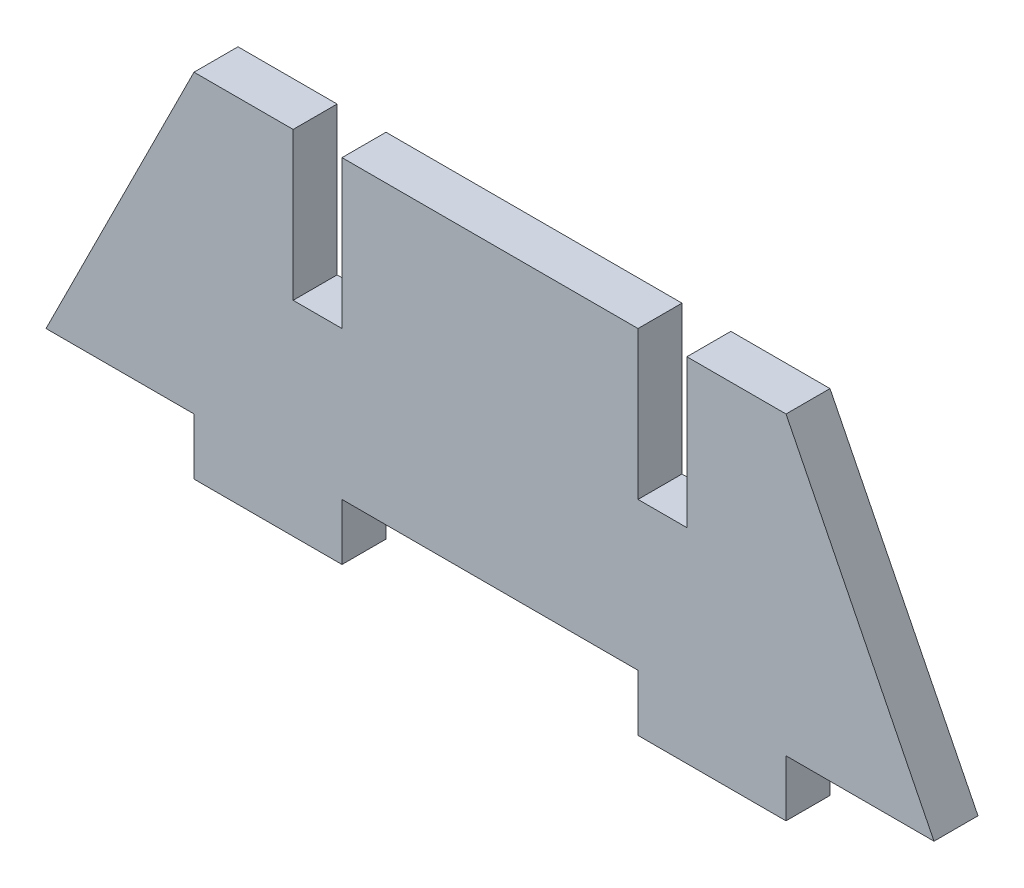
ISO-10303-21;
HEADER;
FILE_DESCRIPTION(('STEP AP214'),'2;1');
FILE_NAME('part.step','',(''),(''),'','','');
FILE_SCHEMA(('AUTOMOTIVE_DESIGN { 1 0 10303 214 1 1 1 1 }'));
ENDSEC;
DATA;
#1=APPLICATION_CONTEXT('core data for automotive mechanical design processes');
#2=APPLICATION_PROTOCOL_DEFINITION('international standard','automotive_design',2000,#1);
#3=PRODUCT_CONTEXT('',#1,'mechanical');
#4=PRODUCT('Part','Part','',(#3));
#5=PRODUCT_RELATED_PRODUCT_CATEGORY('part','',(#4));
#6=PRODUCT_DEFINITION_FORMATION('','',#4);
#7=PRODUCT_DEFINITION_CONTEXT('part definition',#1,'design');
#8=PRODUCT_DEFINITION('design','',#6,#7);
#9=PRODUCT_DEFINITION_SHAPE('','',#8);
#10=(LENGTH_UNIT() NAMED_UNIT(*) SI_UNIT(.MILLI.,.METRE.));
#11=(NAMED_UNIT(*) PLANE_ANGLE_UNIT() SI_UNIT($,.RADIAN.));
#12=(NAMED_UNIT(*) SI_UNIT($,.STERADIAN.) SOLID_ANGLE_UNIT());
#13=UNCERTAINTY_MEASURE_WITH_UNIT(LENGTH_MEASURE(1.E-05),#10,'distance_accuracy_value','');
#14=(GEOMETRIC_REPRESENTATION_CONTEXT(3) GLOBAL_UNCERTAINTY_ASSIGNED_CONTEXT((#13)) GLOBAL_UNIT_ASSIGNED_CONTEXT((#10,
#11,#12)) REPRESENTATION_CONTEXT('',''));
#15=CARTESIAN_POINT('',(0.,0.,0.));
#16=DIRECTION('',(0.,0.,1.));
#17=DIRECTION('',(1.,0.,0.));
#18=AXIS2_PLACEMENT_3D('',#15,#16,#17);
#19=CARTESIAN_POINT('',(-20.,-10.,2.9718));
#20=DIRECTION('',(0.,1.,0.));
#21=DIRECTION('',(0.,0.,1.));
#22=AXIS2_PLACEMENT_3D('',#19,#20,#21);
#23=PLANE('',#22);
#24=DIRECTION('',(1.,0.,0.));
#25=VECTOR('',#24,1.);
#26=CARTESIAN_POINT('',(-20.,-10.,2.9718));
#27=LINE('',#26,#25);
#28=CARTESIAN_POINT('',(20.,-10.,2.9718));
#29=VERTEX_POINT('',#28);
#30=CARTESIAN_POINT('',(30.,-10.,2.9718));
#31=VERTEX_POINT('',#30);
#32=EDGE_CURVE('E48',#29,#31,#27,.T.);
#33=ORIENTED_EDGE('',*,*,#32,.F.);
#34=DIRECTION('',(0.,0.,1.));
#35=VECTOR('',#34,1.);
#36=CARTESIAN_POINT('',(20.,-10.,0.));
#37=LINE('',#36,#35);
#38=CARTESIAN_POINT('',(20.,-10.,0.));
#39=VERTEX_POINT('',#38);
#40=EDGE_CURVE('E203',#39,#29,#37,.T.);
#41=ORIENTED_EDGE('',*,*,#40,.F.);
#42=DIRECTION('',(1.,0.,0.));
#43=VECTOR('',#42,1.);
#44=CARTESIAN_POINT('',(-20.,-10.,0.));
#45=LINE('',#44,#43);
#46=CARTESIAN_POINT('',(30.,-10.,0.));
#47=VERTEX_POINT('',#46);
#48=EDGE_CURVE('E312',#39,#47,#45,.T.);
#49=ORIENTED_EDGE('',*,*,#48,.T.);
#50=DIRECTION('',(0.,0.,1.));
#51=VECTOR('',#50,1.);
#52=CARTESIAN_POINT('',(30.,-10.,0.));
#53=LINE('',#52,#51);
#54=EDGE_CURVE('E285',#47,#31,#53,.T.);
#55=ORIENTED_EDGE('',*,*,#54,.T.);
#56=EDGE_LOOP('',(#33,#41,#49,#55));
#57=FACE_BOUND('',#56,.T.);
#58=ADVANCED_FACE('F33',(#57),#23,.F.);
#59=CARTESIAN_POINT('',(-10.,-10.,0.));
#60=VERTEX_POINT('',#59);
#61=CARTESIAN_POINT('',(10.,-10.,0.));
#62=VERTEX_POINT('',#61);
#63=EDGE_CURVE('E317',#60,#62,#45,.T.);
#64=ORIENTED_EDGE('',*,*,#63,.T.);
#65=DIRECTION('',(0.,0.,1.));
#66=VECTOR('',#65,1.);
#67=CARTESIAN_POINT('',(10.,-10.,0.));
#68=LINE('',#67,#66);
#69=CARTESIAN_POINT('',(10.,-10.,2.9718));
#70=VERTEX_POINT('',#69);
#71=EDGE_CURVE('E56',#62,#70,#68,.T.);
#72=ORIENTED_EDGE('',*,*,#71,.T.);
#73=CARTESIAN_POINT('',(-10.,-10.,2.9718));
#74=VERTEX_POINT('',#73);
#75=EDGE_CURVE('E308',#74,#70,#27,.T.);
#76=ORIENTED_EDGE('',*,*,#75,.F.);
#77=DIRECTION('',(0.,0.,1.));
#78=VECTOR('',#77,1.);
#79=CARTESIAN_POINT('',(-10.,-10.,0.));
#80=LINE('',#79,#78);
#81=EDGE_CURVE('E229',#60,#74,#80,.T.);
#82=ORIENTED_EDGE('',*,*,#81,.F.);
#83=EDGE_LOOP('',(#64,#72,#76,#82));
#84=FACE_BOUND('',#83,.T.);
#85=ADVANCED_FACE('F367',(#84),#23,.F.);
#86=CARTESIAN_POINT('',(-20.,10.,2.9718));
#87=DIRECTION('',(0.,-1.,0.));
#88=DIRECTION('',(0.,0.,-1.));
#89=AXIS2_PLACEMENT_3D('',#86,#87,#88);
#90=PLANE('',#89);
#91=DIRECTION('',(-1.,0.,0.));
#92=VECTOR('',#91,1.);
#93=CARTESIAN_POINT('',(-20.,10.,0.));
#94=LINE('',#93,#92);
#95=CARTESIAN_POINT('',(20.,10.,0.));
#96=VERTEX_POINT('',#95);
#97=CARTESIAN_POINT('',(13.302,10.,0.));
#98=VERTEX_POINT('',#97);
#99=EDGE_CURVE('E309',#96,#98,#94,.T.);
#100=ORIENTED_EDGE('',*,*,#99,.T.);
#101=DIRECTION('',(0.,0.,1.));
#102=VECTOR('',#101,1.);
#103=CARTESIAN_POINT('',(13.302,10.,2.9718));
#104=LINE('',#103,#102);
#105=CARTESIAN_POINT('',(13.302,10.,2.9718));
#106=VERTEX_POINT('',#105);
#107=EDGE_CURVE('E253',#98,#106,#104,.T.);
#108=ORIENTED_EDGE('',*,*,#107,.T.);
#109=DIRECTION('',(-1.,0.,0.));
#110=VECTOR('',#109,1.);
#111=CARTESIAN_POINT('',(-20.,10.,2.9718));
#112=LINE('',#111,#110);
#113=CARTESIAN_POINT('',(20.,10.,2.9718));
#114=VERTEX_POINT('',#113);
#115=EDGE_CURVE('E299',#114,#106,#112,.T.);
#116=ORIENTED_EDGE('',*,*,#115,.F.);
#117=DIRECTION('',(0.,0.,-1.));
#118=VECTOR('',#117,1.);
#119=CARTESIAN_POINT('',(20.,10.,2.9718));
#120=LINE('',#119,#118);
#121=EDGE_CURVE('E320',#114,#96,#120,.T.);
#122=ORIENTED_EDGE('',*,*,#121,.T.);
#123=EDGE_LOOP('',(#100,#108,#116,#122));
#124=FACE_BOUND('',#123,.T.);
#125=ADVANCED_FACE('F376',(#124),#90,.F.);
#126=CARTESIAN_POINT('',(10.,10.,2.9718));
#127=VERTEX_POINT('',#126);
#128=CARTESIAN_POINT('',(-10.,10.,2.9718));
#129=VERTEX_POINT('',#128);
#130=EDGE_CURVE('E302',#127,#129,#112,.T.);
#131=ORIENTED_EDGE('',*,*,#130,.F.);
#132=DIRECTION('',(0.,0.,-1.));
#133=VECTOR('',#132,1.);
#134=CARTESIAN_POINT('',(10.,10.,2.9718));
#135=LINE('',#134,#133);
#136=CARTESIAN_POINT('',(10.,10.,0.));
#137=VERTEX_POINT('',#136);
#138=EDGE_CURVE('E248',#127,#137,#135,.T.);
#139=ORIENTED_EDGE('',*,*,#138,.T.);
#140=CARTESIAN_POINT('',(-10.,10.,0.));
#141=VERTEX_POINT('',#140);
#142=EDGE_CURVE('E313',#137,#141,#94,.T.);
#143=ORIENTED_EDGE('',*,*,#142,.T.);
#144=DIRECTION('',(0.,0.,1.));
#145=VECTOR('',#144,1.);
#146=CARTESIAN_POINT('',(-10.,10.,2.9718));
#147=LINE('',#146,#145);
#148=EDGE_CURVE('E278',#141,#129,#147,.T.);
#149=ORIENTED_EDGE('',*,*,#148,.T.);
#150=EDGE_LOOP('',(#131,#139,#143,#149));
#151=FACE_BOUND('',#150,.T.);
#152=ADVANCED_FACE('F336',(#151),#90,.F.);
#153=CARTESIAN_POINT('',(-13.302,10.,2.9718));
#154=VERTEX_POINT('',#153);
#155=CARTESIAN_POINT('',(-20.,10.,2.9718));
#156=VERTEX_POINT('',#155);
#157=EDGE_CURVE('E303',#154,#156,#112,.T.);
#158=ORIENTED_EDGE('',*,*,#157,.F.);
#159=DIRECTION('',(0.,0.,-1.));
#160=VECTOR('',#159,1.);
#161=CARTESIAN_POINT('',(-13.302,10.,2.9718));
#162=LINE('',#161,#160);
#163=CARTESIAN_POINT('',(-13.302,10.,0.));
#164=VERTEX_POINT('',#163);
#165=EDGE_CURVE('E273',#154,#164,#162,.T.);
#166=ORIENTED_EDGE('',*,*,#165,.T.);
#167=CARTESIAN_POINT('',(-20.,10.,0.));
#168=VERTEX_POINT('',#167);
#169=EDGE_CURVE('E298',#164,#168,#94,.T.);
#170=ORIENTED_EDGE('',*,*,#169,.T.);
#171=DIRECTION('',(0.,0.,-1.));
#172=VECTOR('',#171,1.);
#173=CARTESIAN_POINT('',(-20.,10.,2.9718));
#174=LINE('',#173,#172);
#175=EDGE_CURVE('E307',#156,#168,#174,.T.);
#176=ORIENTED_EDGE('',*,*,#175,.F.);
#177=EDGE_LOOP('',(#158,#166,#170,#176));
#178=FACE_BOUND('',#177,.T.);
#179=ADVANCED_FACE('F35',(#178),#90,.F.);
#180=CARTESIAN_POINT('',(-30.,-10.,0.));
#181=VERTEX_POINT('',#180);
#182=CARTESIAN_POINT('',(-20.,-10.,0.));
#183=VERTEX_POINT('',#182);
#184=EDGE_CURVE('E314',#181,#183,#45,.T.);
#185=ORIENTED_EDGE('',*,*,#184,.T.);
#186=DIRECTION('',(0.,0.,1.));
#187=VECTOR('',#186,1.);
#188=CARTESIAN_POINT('',(-20.,-10.,0.));
#189=LINE('',#188,#187);
#190=CARTESIAN_POINT('',(-20.,-10.,2.9718));
#191=VERTEX_POINT('',#190);
#192=EDGE_CURVE('E225',#183,#191,#189,.T.);
#193=ORIENTED_EDGE('',*,*,#192,.T.);
#194=CARTESIAN_POINT('',(-30.,-10.,2.9718));
#195=VERTEX_POINT('',#194);
#196=EDGE_CURVE('E304',#195,#191,#27,.T.);
#197=ORIENTED_EDGE('',*,*,#196,.F.);
#198=DIRECTION('',(0.,0.,1.));
#199=VECTOR('',#198,1.);
#200=CARTESIAN_POINT('',(-30.,-10.,0.));
#201=LINE('',#200,#199);
#202=EDGE_CURVE('E293',#181,#195,#201,.T.);
#203=ORIENTED_EDGE('',*,*,#202,.F.);
#204=EDGE_LOOP('',(#185,#193,#197,#203));
#205=FACE_BOUND('',#204,.T.);
#206=ADVANCED_FACE('F354',(#205),#23,.F.);
#207=CARTESIAN_POINT('',(0.,0.,2.9718));
#208=DIRECTION('',(0.,0.,-1.));
#209=DIRECTION('',(-1.,0.,0.));
#210=AXIS2_PLACEMENT_3D('',#207,#208,#209);
#211=PLANE('',#210);
#212=ORIENTED_EDGE('',*,*,#115,.T.);
#213=DIRECTION('',(0.,1.,0.));
#214=VECTOR('',#213,1.);
#215=CARTESIAN_POINT('',(13.302,20.,2.9718));
#216=LINE('',#215,#214);
#217=CARTESIAN_POINT('',(13.302,0.,2.9718));
#218=VERTEX_POINT('',#217);
#219=EDGE_CURVE('E238',#218,#106,#216,.T.);
#220=ORIENTED_EDGE('',*,*,#219,.F.);
#221=DIRECTION('',(1.,0.,0.));
#222=VECTOR('',#221,1.);
#223=CARTESIAN_POINT('',(13.302,0.,2.9718));
#224=LINE('',#223,#222);
#225=CARTESIAN_POINT('',(10.,0.,2.9718));
#226=VERTEX_POINT('',#225);
#227=EDGE_CURVE('E242',#226,#218,#224,.T.);
#228=ORIENTED_EDGE('',*,*,#227,.F.);
#229=DIRECTION('',(0.,-1.,0.));
#230=VECTOR('',#229,1.);
#231=CARTESIAN_POINT('',(10.,20.,2.9718));
#232=LINE('',#231,#230);
#233=EDGE_CURVE('E228',#127,#226,#232,.T.);
#234=ORIENTED_EDGE('',*,*,#233,.F.);
#235=ORIENTED_EDGE('',*,*,#130,.T.);
#236=DIRECTION('',(0.,1.,0.));
#237=VECTOR('',#236,1.);
#238=CARTESIAN_POINT('',(-10.,20.,2.9718));
#239=LINE('',#238,#237);
#240=CARTESIAN_POINT('',(-10.,0.,2.9718));
#241=VERTEX_POINT('',#240);
#242=EDGE_CURVE('E256',#241,#129,#239,.T.);
#243=ORIENTED_EDGE('',*,*,#242,.F.);
#244=DIRECTION('',(1.,0.,0.));
#245=VECTOR('',#244,1.);
#246=CARTESIAN_POINT('',(-13.302,0.,2.9718));
#247=LINE('',#246,#245);
#248=CARTESIAN_POINT('',(-13.302,0.,2.9718));
#249=VERTEX_POINT('',#248);
#250=EDGE_CURVE('E261',#249,#241,#247,.T.);
#251=ORIENTED_EDGE('',*,*,#250,.F.);
#252=DIRECTION('',(0.,-1.,0.));
#253=VECTOR('',#252,1.);
#254=CARTESIAN_POINT('',(-13.302,20.,2.9718));
#255=LINE('',#254,#253);
#256=EDGE_CURVE('E267',#154,#249,#255,.T.);
#257=ORIENTED_EDGE('',*,*,#256,.F.);
#258=ORIENTED_EDGE('',*,*,#157,.T.);
#259=DIRECTION('',(-0.447213595499958,-0.894427190999916,0.));
#260=VECTOR('',#259,1.);
#261=CARTESIAN_POINT('',(-20.,10.,2.9718));
#262=LINE('',#261,#260);
#263=EDGE_CURVE('E289',#156,#195,#262,.T.);
#264=ORIENTED_EDGE('',*,*,#263,.T.);
#265=ORIENTED_EDGE('',*,*,#196,.T.);
#266=DIRECTION('',(0.,-1.,0.));
#267=VECTOR('',#266,1.);
#268=CARTESIAN_POINT('',(-20.,-10.,2.9718));
#269=LINE('',#268,#267);
#270=CARTESIAN_POINT('',(-20.,-13.81,2.9718));
#271=VERTEX_POINT('',#270);
#272=EDGE_CURVE('E205',#191,#271,#269,.T.);
#273=ORIENTED_EDGE('',*,*,#272,.T.);
#274=DIRECTION('',(1.,0.,0.));
#275=VECTOR('',#274,1.);
#276=CARTESIAN_POINT('',(-20.,-13.81,2.9718));
#277=LINE('',#276,#275);
#278=CARTESIAN_POINT('',(-10.,-13.81,2.9718));
#279=VERTEX_POINT('',#278);
#280=EDGE_CURVE('E220',#271,#279,#277,.T.);
#281=ORIENTED_EDGE('',*,*,#280,.T.);
#282=DIRECTION('',(0.,1.,0.));
#283=VECTOR('',#282,1.);
#284=CARTESIAN_POINT('',(-10.,-10.,2.9718));
#285=LINE('',#284,#283);
#286=EDGE_CURVE('E212',#279,#74,#285,.T.);
#287=ORIENTED_EDGE('',*,*,#286,.T.);
#288=ORIENTED_EDGE('',*,*,#75,.T.);
#289=DIRECTION('',(0.,-1.,0.));
#290=VECTOR('',#289,1.);
#291=CARTESIAN_POINT('',(10.,-10.,2.9718));
#292=LINE('',#291,#290);
#293=CARTESIAN_POINT('',(10.,-13.81,2.9718));
#294=VERTEX_POINT('',#293);
#295=EDGE_CURVE('E200',#70,#294,#292,.T.);
#296=ORIENTED_EDGE('',*,*,#295,.T.);
#297=DIRECTION('',(1.,0.,0.));
#298=VECTOR('',#297,1.);
#299=CARTESIAN_POINT('',(20.,-13.81,2.9718));
#300=LINE('',#299,#298);
#301=CARTESIAN_POINT('',(20.,-13.81,2.9718));
#302=VERTEX_POINT('',#301);
#303=EDGE_CURVE('E177',#294,#302,#300,.T.);
#304=ORIENTED_EDGE('',*,*,#303,.T.);
#305=DIRECTION('',(0.,1.,0.));
#306=VECTOR('',#305,1.);
#307=CARTESIAN_POINT('',(20.,-10.,2.9718));
#308=LINE('',#307,#306);
#309=EDGE_CURVE('E194',#302,#29,#308,.T.);
#310=ORIENTED_EDGE('',*,*,#309,.T.);
#311=ORIENTED_EDGE('',*,*,#32,.T.);
#312=DIRECTION('',(-0.447213595499958,0.894427190999916,0.));
#313=VECTOR('',#312,1.);
#314=CARTESIAN_POINT('',(20.,10.,2.9718));
#315=LINE('',#314,#313);
#316=EDGE_CURVE('E281',#31,#114,#315,.T.);
#317=ORIENTED_EDGE('',*,*,#316,.T.);
#318=EDGE_LOOP('',(#212,#220,#228,#234,#235,#243,#251,#257,#258,#264,#265,#273,#281,#287,#288,
#296,#304,#310,#311,#317));
#319=FACE_BOUND('',#318,.T.);
#320=ADVANCED_FACE('F346',(#319),#211,.F.);
#321=CARTESIAN_POINT('',(0.,0.,0.));
#322=DIRECTION('',(0.,0.,-1.));
#323=DIRECTION('',(-1.,0.,0.));
#324=AXIS2_PLACEMENT_3D('',#321,#322,#323);
#325=PLANE('',#324);
#326=DIRECTION('',(0.,1.,0.));
#327=VECTOR('',#326,1.);
#328=CARTESIAN_POINT('',(13.302,20.,0.));
#329=LINE('',#328,#327);
#330=CARTESIAN_POINT('',(13.302,0.,0.));
#331=VERTEX_POINT('',#330);
#332=EDGE_CURVE('E237',#331,#98,#329,.T.);
#333=ORIENTED_EDGE('',*,*,#332,.T.);
#334=ORIENTED_EDGE('',*,*,#99,.F.);
#335=DIRECTION('',(-0.447213595499958,0.894427190999916,0.));
#336=VECTOR('',#335,1.);
#337=CARTESIAN_POINT('',(20.,10.,0.));
#338=LINE('',#337,#336);
#339=EDGE_CURVE('E282',#47,#96,#338,.T.);
#340=ORIENTED_EDGE('',*,*,#339,.F.);
#341=ORIENTED_EDGE('',*,*,#48,.F.);
#342=DIRECTION('',(0.,1.,0.));
#343=VECTOR('',#342,1.);
#344=CARTESIAN_POINT('',(20.,-10.,0.));
#345=LINE('',#344,#343);
#346=CARTESIAN_POINT('',(20.,-13.81,0.));
#347=VERTEX_POINT('',#346);
#348=EDGE_CURVE('E191',#347,#39,#345,.T.);
#349=ORIENTED_EDGE('',*,*,#348,.F.);
#350=DIRECTION('',(1.,0.,0.));
#351=VECTOR('',#350,1.);
#352=CARTESIAN_POINT('',(20.,-13.81,0.));
#353=LINE('',#352,#351);
#354=CARTESIAN_POINT('',(10.,-13.81,0.));
#355=VERTEX_POINT('',#354);
#356=EDGE_CURVE('E174',#355,#347,#353,.T.);
#357=ORIENTED_EDGE('',*,*,#356,.F.);
#358=DIRECTION('',(0.,-1.,0.));
#359=VECTOR('',#358,1.);
#360=CARTESIAN_POINT('',(10.,-10.,0.));
#361=LINE('',#360,#359);
#362=EDGE_CURVE('E189',#62,#355,#361,.T.);
#363=ORIENTED_EDGE('',*,*,#362,.F.);
#364=ORIENTED_EDGE('',*,*,#63,.F.);
#365=DIRECTION('',(0.,1.,0.));
#366=VECTOR('',#365,1.);
#367=CARTESIAN_POINT('',(-10.,-10.,0.));
#368=LINE('',#367,#366);
#369=CARTESIAN_POINT('',(-10.,-13.81,0.));
#370=VERTEX_POINT('',#369);
#371=EDGE_CURVE('E215',#370,#60,#368,.T.);
#372=ORIENTED_EDGE('',*,*,#371,.F.);
#373=DIRECTION('',(1.,0.,0.));
#374=VECTOR('',#373,1.);
#375=CARTESIAN_POINT('',(-20.,-13.81,0.));
#376=LINE('',#375,#374);
#377=CARTESIAN_POINT('',(-20.,-13.81,0.));
#378=VERTEX_POINT('',#377);
#379=EDGE_CURVE('E211',#378,#370,#376,.T.);
#380=ORIENTED_EDGE('',*,*,#379,.F.);
#381=DIRECTION('',(0.,-1.,0.));
#382=VECTOR('',#381,1.);
#383=CARTESIAN_POINT('',(-20.,-10.,0.));
#384=LINE('',#383,#382);
#385=EDGE_CURVE('E208',#183,#378,#384,.T.);
#386=ORIENTED_EDGE('',*,*,#385,.F.);
#387=ORIENTED_EDGE('',*,*,#184,.F.);
#388=DIRECTION('',(-0.447213595499958,-0.894427190999916,0.));
#389=VECTOR('',#388,1.);
#390=CARTESIAN_POINT('',(-20.,10.,0.));
#391=LINE('',#390,#389);
#392=EDGE_CURVE('E290',#168,#181,#391,.T.);
#393=ORIENTED_EDGE('',*,*,#392,.F.);
#394=ORIENTED_EDGE('',*,*,#169,.F.);
#395=DIRECTION('',(0.,1.,0.));
#396=VECTOR('',#395,1.);
#397=CARTESIAN_POINT('',(-13.302,0.,0.));
#398=LINE('',#397,#396);
#399=CARTESIAN_POINT('',(-13.302,0.,0.));
#400=VERTEX_POINT('',#399);
#401=EDGE_CURVE('E41',#400,#164,#398,.T.);
#402=ORIENTED_EDGE('',*,*,#401,.F.);
#403=DIRECTION('',(1.,0.,0.));
#404=VECTOR('',#403,1.);
#405=CARTESIAN_POINT('',(-13.302,0.,0.));
#406=LINE('',#405,#404);
#407=CARTESIAN_POINT('',(-10.,0.,0.));
#408=VERTEX_POINT('',#407);
#409=EDGE_CURVE('E260',#400,#408,#406,.T.);
#410=ORIENTED_EDGE('',*,*,#409,.T.);
#411=DIRECTION('',(0.,1.,0.));
#412=VECTOR('',#411,1.);
#413=CARTESIAN_POINT('',(-10.,20.,0.));
#414=LINE('',#413,#412);
#415=EDGE_CURVE('E257',#408,#141,#414,.T.);
#416=ORIENTED_EDGE('',*,*,#415,.T.);
#417=ORIENTED_EDGE('',*,*,#142,.F.);
#418=DIRECTION('',(0.,1.,0.));
#419=VECTOR('',#418,1.);
#420=CARTESIAN_POINT('',(10.,0.,0.));
#421=LINE('',#420,#419);
#422=CARTESIAN_POINT('',(10.,0.,0.));
#423=VERTEX_POINT('',#422);
#424=EDGE_CURVE('E11',#423,#137,#421,.T.);
#425=ORIENTED_EDGE('',*,*,#424,.F.);
#426=DIRECTION('',(1.,0.,0.));
#427=VECTOR('',#426,1.);
#428=CARTESIAN_POINT('',(13.302,0.,0.));
#429=LINE('',#428,#427);
#430=EDGE_CURVE('E234',#423,#331,#429,.T.);
#431=ORIENTED_EDGE('',*,*,#430,.T.);
#432=EDGE_LOOP('',(#333,#334,#340,#341,#349,#357,#363,#364,#372,#380,#386,#387,#393,#394,#402,
#410,#416,#417,#425,#431));
#433=FACE_BOUND('',#432,.T.);
#434=ADVANCED_FACE('F187',(#433),#325,.T.);
#435=CARTESIAN_POINT('',(-20.,10.,0.));
#436=DIRECTION('',(-0.894427190999916,0.447213595499958,0.));
#437=DIRECTION('',(-0.447213595499958,-0.894427190999916,0.));
#438=AXIS2_PLACEMENT_3D('',#435,#436,#437);
#439=PLANE('',#438);
#440=ORIENTED_EDGE('',*,*,#263,.F.);
#441=ORIENTED_EDGE('',*,*,#175,.T.);
#442=ORIENTED_EDGE('',*,*,#392,.T.);
#443=ORIENTED_EDGE('',*,*,#202,.T.);
#444=EDGE_LOOP('',(#440,#441,#442,#443));
#445=FACE_BOUND('',#444,.T.);
#446=ADVANCED_FACE('F351',(#445),#439,.T.);
#447=CARTESIAN_POINT('',(20.,10.,0.));
#448=DIRECTION('',(0.894427190999916,0.447213595499958,0.));
#449=DIRECTION('',(-0.447213595499958,0.894427190999916,0.));
#450=AXIS2_PLACEMENT_3D('',#447,#448,#449);
#451=PLANE('',#450);
#452=ORIENTED_EDGE('',*,*,#316,.F.);
#453=ORIENTED_EDGE('',*,*,#54,.F.);
#454=ORIENTED_EDGE('',*,*,#339,.T.);
#455=ORIENTED_EDGE('',*,*,#121,.F.);
#456=EDGE_LOOP('',(#452,#453,#454,#455));
#457=FACE_BOUND('',#456,.T.);
#458=ADVANCED_FACE('F374',(#457),#451,.T.);
#459=CARTESIAN_POINT('',(-10.,20.,0.));
#460=DIRECTION('',(1.,0.,0.));
#461=DIRECTION('',(0.,1.,0.));
#462=AXIS2_PLACEMENT_3D('',#459,#460,#461);
#463=PLANE('',#462);
#464=ORIENTED_EDGE('',*,*,#415,.F.);
#465=DIRECTION('',(0.,0.,1.));
#466=VECTOR('',#465,1.);
#467=CARTESIAN_POINT('',(-10.,0.,0.));
#468=LINE('',#467,#466);
#469=EDGE_CURVE('E271',#408,#241,#468,.T.);
#470=ORIENTED_EDGE('',*,*,#469,.T.);
#471=ORIENTED_EDGE('',*,*,#242,.T.);
#472=ORIENTED_EDGE('',*,*,#148,.F.);
#473=EDGE_LOOP('',(#464,#470,#471,#472));
#474=FACE_BOUND('',#473,.T.);
#475=ADVANCED_FACE('F340',(#474),#463,.F.);
#476=CARTESIAN_POINT('',(-13.302,20.,0.));
#477=DIRECTION('',(-1.,0.,0.));
#478=DIRECTION('',(0.,0.,1.));
#479=AXIS2_PLACEMENT_3D('',#476,#477,#478);
#480=PLANE('',#479);
#481=ORIENTED_EDGE('',*,*,#256,.T.);
#482=DIRECTION('',(0.,0.,1.));
#483=VECTOR('',#482,1.);
#484=CARTESIAN_POINT('',(-13.302,0.,0.));
#485=LINE('',#484,#483);
#486=EDGE_CURVE('E264',#400,#249,#485,.T.);
#487=ORIENTED_EDGE('',*,*,#486,.F.);
#488=ORIENTED_EDGE('',*,*,#401,.T.);
#489=ORIENTED_EDGE('',*,*,#165,.F.);
#490=EDGE_LOOP('',(#481,#487,#488,#489));
#491=FACE_BOUND('',#490,.T.);
#492=ADVANCED_FACE('F325',(#491),#480,.F.);
#493=CARTESIAN_POINT('',(-13.302,0.,0.));
#494=DIRECTION('',(0.,-1.,0.));
#495=DIRECTION('',(0.,0.,-1.));
#496=AXIS2_PLACEMENT_3D('',#493,#494,#495);
#497=PLANE('',#496);
#498=ORIENTED_EDGE('',*,*,#250,.T.);
#499=ORIENTED_EDGE('',*,*,#469,.F.);
#500=ORIENTED_EDGE('',*,*,#409,.F.);
#501=ORIENTED_EDGE('',*,*,#486,.T.);
#502=EDGE_LOOP('',(#498,#499,#500,#501));
#503=FACE_BOUND('',#502,.T.);
#504=ADVANCED_FACE('F343',(#503),#497,.F.);
#505=CARTESIAN_POINT('',(13.302,20.,0.));
#506=DIRECTION('',(1.,0.,0.));
#507=DIRECTION('',(0.,0.,-1.));
#508=AXIS2_PLACEMENT_3D('',#505,#506,#507);
#509=PLANE('',#508);
#510=ORIENTED_EDGE('',*,*,#332,.F.);
#511=DIRECTION('',(0.,0.,1.));
#512=VECTOR('',#511,1.);
#513=CARTESIAN_POINT('',(13.302,0.,0.));
#514=LINE('',#513,#512);
#515=EDGE_CURVE('E246',#331,#218,#514,.T.);
#516=ORIENTED_EDGE('',*,*,#515,.T.);
#517=ORIENTED_EDGE('',*,*,#219,.T.);
#518=ORIENTED_EDGE('',*,*,#107,.F.);
#519=EDGE_LOOP('',(#510,#516,#517,#518));
#520=FACE_BOUND('',#519,.T.);
#521=ADVANCED_FACE('F380',(#520),#509,.F.);
#522=CARTESIAN_POINT('',(10.,20.,0.));
#523=DIRECTION('',(-1.,0.,0.));
#524=DIRECTION('',(0.,-1.,0.));
#525=AXIS2_PLACEMENT_3D('',#522,#523,#524);
#526=PLANE('',#525);
#527=ORIENTED_EDGE('',*,*,#233,.T.);
#528=DIRECTION('',(0.,0.,1.));
#529=VECTOR('',#528,1.);
#530=CARTESIAN_POINT('',(10.,0.,0.));
#531=LINE('',#530,#529);
#532=EDGE_CURVE('E240',#423,#226,#531,.T.);
#533=ORIENTED_EDGE('',*,*,#532,.F.);
#534=ORIENTED_EDGE('',*,*,#424,.T.);
#535=ORIENTED_EDGE('',*,*,#138,.F.);
#536=EDGE_LOOP('',(#527,#533,#534,#535));
#537=FACE_BOUND('',#536,.T.);
#538=ADVANCED_FACE('F385',(#537),#526,.F.);
#539=CARTESIAN_POINT('',(13.302,0.,0.));
#540=DIRECTION('',(0.,-1.,0.));
#541=DIRECTION('',(0.,0.,-1.));
#542=AXIS2_PLACEMENT_3D('',#539,#540,#541);
#543=PLANE('',#542);
#544=ORIENTED_EDGE('',*,*,#227,.T.);
#545=ORIENTED_EDGE('',*,*,#515,.F.);
#546=ORIENTED_EDGE('',*,*,#430,.F.);
#547=ORIENTED_EDGE('',*,*,#532,.T.);
#548=EDGE_LOOP('',(#544,#545,#546,#547));
#549=FACE_BOUND('',#548,.T.);
#550=ADVANCED_FACE('F382',(#549),#543,.F.);
#551=CARTESIAN_POINT('',(-20.,-10.,0.));
#552=DIRECTION('',(-1.,0.,0.));
#553=DIRECTION('',(0.,0.,1.));
#554=AXIS2_PLACEMENT_3D('',#551,#552,#553);
#555=PLANE('',#554);
#556=ORIENTED_EDGE('',*,*,#272,.F.);
#557=ORIENTED_EDGE('',*,*,#192,.F.);
#558=ORIENTED_EDGE('',*,*,#385,.T.);
#559=DIRECTION('',(0.,0.,1.));
#560=VECTOR('',#559,1.);
#561=CARTESIAN_POINT('',(-20.,-13.81,0.));
#562=LINE('',#561,#560);
#563=EDGE_CURVE('E217',#378,#271,#562,.T.);
#564=ORIENTED_EDGE('',*,*,#563,.T.);
#565=EDGE_LOOP('',(#556,#557,#558,#564));
#566=FACE_BOUND('',#565,.T.);
#567=ADVANCED_FACE('F357',(#566),#555,.T.);
#568=CARTESIAN_POINT('',(-10.,-10.,0.));
#569=DIRECTION('',(1.,0.,0.));
#570=DIRECTION('',(0.,0.,-1.));
#571=AXIS2_PLACEMENT_3D('',#568,#569,#570);
#572=PLANE('',#571);
#573=ORIENTED_EDGE('',*,*,#286,.F.);
#574=DIRECTION('',(0.,0.,1.));
#575=VECTOR('',#574,1.);
#576=CARTESIAN_POINT('',(-10.,-13.81,0.));
#577=LINE('',#576,#575);
#578=EDGE_CURVE('E231',#370,#279,#577,.T.);
#579=ORIENTED_EDGE('',*,*,#578,.F.);
#580=ORIENTED_EDGE('',*,*,#371,.T.);
#581=ORIENTED_EDGE('',*,*,#81,.T.);
#582=EDGE_LOOP('',(#573,#579,#580,#581));
#583=FACE_BOUND('',#582,.T.);
#584=ADVANCED_FACE('F365',(#583),#572,.T.);
#585=CARTESIAN_POINT('',(-20.,-13.81,0.));
#586=DIRECTION('',(0.,-1.,0.));
#587=DIRECTION('',(0.,0.,-1.));
#588=AXIS2_PLACEMENT_3D('',#585,#586,#587);
#589=PLANE('',#588);
#590=ORIENTED_EDGE('',*,*,#280,.F.);
#591=ORIENTED_EDGE('',*,*,#563,.F.);
#592=ORIENTED_EDGE('',*,*,#379,.T.);
#593=ORIENTED_EDGE('',*,*,#578,.T.);
#594=EDGE_LOOP('',(#590,#591,#592,#593));
#595=FACE_BOUND('',#594,.T.);
#596=ADVANCED_FACE('F361',(#595),#589,.T.);
#597=CARTESIAN_POINT('',(20.,-10.,0.));
#598=DIRECTION('',(1.,0.,0.));
#599=DIRECTION('',(0.,0.,-1.));
#600=AXIS2_PLACEMENT_3D('',#597,#598,#599);
#601=PLANE('',#600);
#602=ORIENTED_EDGE('',*,*,#309,.F.);
#603=DIRECTION('',(0.,0.,1.));
#604=VECTOR('',#603,1.);
#605=CARTESIAN_POINT('',(20.,-13.81,0.));
#606=LINE('',#605,#604);
#607=EDGE_CURVE('E182',#347,#302,#606,.T.);
#608=ORIENTED_EDGE('',*,*,#607,.F.);
#609=ORIENTED_EDGE('',*,*,#348,.T.);
#610=ORIENTED_EDGE('',*,*,#40,.T.);
#611=EDGE_LOOP('',(#602,#608,#609,#610));
#612=FACE_BOUND('',#611,.T.);
#613=ADVANCED_FACE('F387',(#612),#601,.T.);
#614=CARTESIAN_POINT('',(20.,-13.81,0.));
#615=DIRECTION('',(0.,-1.,0.));
#616=DIRECTION('',(0.,0.,-1.));
#617=AXIS2_PLACEMENT_3D('',#614,#615,#616);
#618=PLANE('',#617);
#619=ORIENTED_EDGE('',*,*,#303,.F.);
#620=DIRECTION('',(0.,0.,1.));
#621=VECTOR('',#620,1.);
#622=CARTESIAN_POINT('',(10.,-13.81,0.));
#623=LINE('',#622,#621);
#624=EDGE_CURVE('E171',#355,#294,#623,.T.);
#625=ORIENTED_EDGE('',*,*,#624,.F.);
#626=ORIENTED_EDGE('',*,*,#356,.T.);
#627=ORIENTED_EDGE('',*,*,#607,.T.);
#628=EDGE_LOOP('',(#619,#625,#626,#627));
#629=FACE_BOUND('',#628,.T.);
#630=ADVANCED_FACE('F173',(#629),#618,.T.);
#631=CARTESIAN_POINT('',(10.,-10.,0.));
#632=DIRECTION('',(-1.,0.,0.));
#633=DIRECTION('',(0.,0.,1.));
#634=AXIS2_PLACEMENT_3D('',#631,#632,#633);
#635=PLANE('',#634);
#636=ORIENTED_EDGE('',*,*,#295,.F.);
#637=ORIENTED_EDGE('',*,*,#71,.F.);
#638=ORIENTED_EDGE('',*,*,#362,.T.);
#639=ORIENTED_EDGE('',*,*,#624,.T.);
#640=EDGE_LOOP('',(#636,#637,#638,#639));
#641=FACE_BOUND('',#640,.T.);
#642=ADVANCED_FACE('F193',(#641),#635,.T.);
#643=CLOSED_SHELL('',(#58,#85,#125,#152,#179,#206,#320,#434,#446,#458,#475,#492,#504,#521,#538,
#550,#567,#584,#596,#613,#630,#642));
#644=MANIFOLD_SOLID_BREP('B2',#643);
#645=ADVANCED_BREP_SHAPE_REPRESENTATION('',(#18,#644),#14);
#646=SHAPE_DEFINITION_REPRESENTATION(#9,#645);
ENDSEC;
END-ISO-10303-21;
